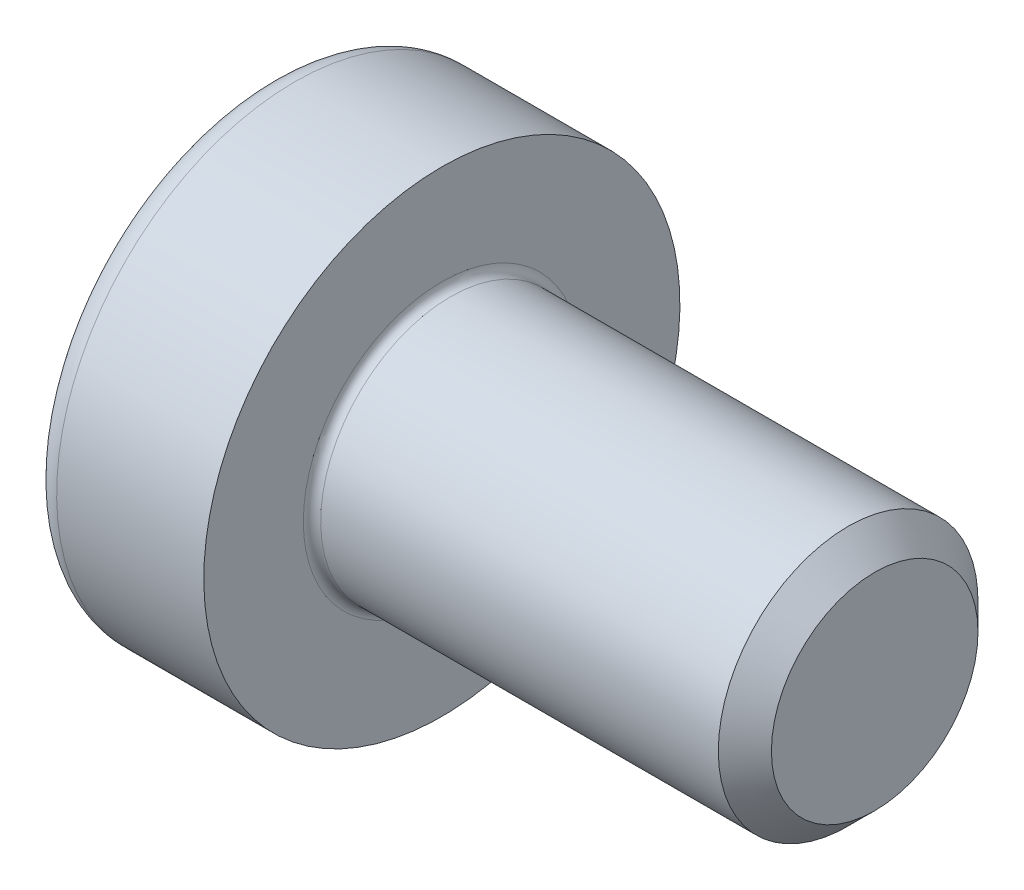
ISO-10303-21;
HEADER;
FILE_DESCRIPTION(('STEP AP214'),'2;1');
FILE_NAME('part.step','',(''),(''),'','','');
FILE_SCHEMA(('AUTOMOTIVE_DESIGN { 1 0 10303 214 1 1 1 1 }'));
ENDSEC;
DATA;
#1=APPLICATION_CONTEXT('core data for automotive mechanical design processes');
#2=APPLICATION_PROTOCOL_DEFINITION('international standard','automotive_design',2000,#1);
#3=PRODUCT_CONTEXT('',#1,'mechanical');
#4=PRODUCT('Part','Part','',(#3));
#5=PRODUCT_RELATED_PRODUCT_CATEGORY('part','',(#4));
#6=PRODUCT_DEFINITION_FORMATION('','',#4);
#7=PRODUCT_DEFINITION_CONTEXT('part definition',#1,'design');
#8=PRODUCT_DEFINITION('design','',#6,#7);
#9=PRODUCT_DEFINITION_SHAPE('','',#8);
#10=(LENGTH_UNIT() NAMED_UNIT(*) SI_UNIT(.MILLI.,.METRE.));
#11=(NAMED_UNIT(*) PLANE_ANGLE_UNIT() SI_UNIT($,.RADIAN.));
#12=(NAMED_UNIT(*) SI_UNIT($,.STERADIAN.) SOLID_ANGLE_UNIT());
#13=UNCERTAINTY_MEASURE_WITH_UNIT(LENGTH_MEASURE(1.E-05),#10,'distance_accuracy_value','');
#14=(GEOMETRIC_REPRESENTATION_CONTEXT(3) GLOBAL_UNCERTAINTY_ASSIGNED_CONTEXT((#13)) GLOBAL_UNIT_ASSIGNED_CONTEXT((#10,
#11,#12)) REPRESENTATION_CONTEXT('',''));
#15=CARTESIAN_POINT('',(0.,0.,0.));
#16=DIRECTION('',(0.,0.,1.));
#17=DIRECTION('',(1.,0.,0.));
#18=AXIS2_PLACEMENT_3D('',#15,#16,#17);
#19=CARTESIAN_POINT('',(-0.503999999864391,0.,0.));
#20=DIRECTION('',(-1.,0.,0.));
#21=DIRECTION('',(0.,-1.,0.));
#22=AXIS2_PLACEMENT_3D('',#19,#20,#21);
#23=CONICAL_SURFACE('',#22,1.16162874127212,1.04719755078912);
#24=CARTESIAN_POINT('',(0.166666666927995,-2.27373675443232E-10,0.));
#25=VERTEX_POINT('',#24);
#26=VERTEX_LOOP('',#25);
#27=FACE_BOUND('',#26,.T.);
#28=CARTESIAN_POINT('',(-0.500000000054538,-2.66034933447051E-12,-1.15470053837771));
#29=CARTESIAN_POINT('',(-0.485347772602941,-0.0439439437877839,-1.12932949060412));
#30=CARTESIAN_POINT('',(-0.472022338576027,-0.0882672110712172,-1.10373944030667));
#31=CARTESIAN_POINT('',(-0.448763193702326,-0.177681173363933,-1.05211626510765));
#32=CARTESIAN_POINT('',(-0.438837710161239,-0.22277345656913,-1.02608222326076));
#33=CARTESIAN_POINT('',(-0.423387979450925,-0.31239921691698,-0.974336766397603));
#34=CARTESIAN_POINT('',(-0.417760893771708,-0.356918907850494,-0.9486333108529));
#35=CARTESIAN_POINT('',(-0.411044584034606,-0.446167660283064,-0.897105519611117));
#36=CARTESIAN_POINT('',(-0.409949796957221,-0.490896397609755,-0.87128137107504));
#37=CARTESIAN_POINT('',(-0.412233145053628,-0.574467244911864,-0.823031719888762));
#38=CARTESIAN_POINT('',(-0.415050642588264,-0.613321895373819,-0.800598976985284));
#39=CARTESIAN_POINT('',(-0.423978650349042,-0.690778070923615,-0.75587963318121));
#40=CARTESIAN_POINT('',(-0.430092207380232,-0.729379328311183,-0.73359318683744));
#41=CARTESIAN_POINT('',(-0.445374916678936,-0.806995070887484,-0.688781716967659));
#42=CARTESIAN_POINT('',(-0.454608821127005,-0.845999737712036,-0.666262362076853));
#43=CARTESIAN_POINT('',(-0.475565880455007,-0.92342748501189,-0.621559431330535));
#44=CARTESIAN_POINT('',(-0.48728411442082,-0.961851556660948,-0.599375283220591));
#45=CARTESIAN_POINT('',(-0.500000000054538,-0.999999999997338,-0.57735026919116));
#46=B_SPLINE_CURVE_WITH_KNOTS('',3,(#28,#29,#30,#31,#32,#33,#34,#35,#36,#37,#38,#39,#40,#41,#42,
#43,#44,#45),.UNSPECIFIED.,.F.,.F.,(4,2,2,2,2,2,2,2,4),(0.,0.158508005803016,0.317396908563659,
0.472353803143989,0.627120444533385,0.761853891383376,0.89671209694782,1.03456081128291,
1.17213898678349),.UNSPECIFIED.);
#47=CARTESIAN_POINT('',(-0.500000000054409,3.90597052142701E-13,-1.15470053837749));
#48=VERTEX_POINT('',#47);
#49=CARTESIAN_POINT('',(-0.500000000054982,-0.999999999998669,-0.577350269190392));
#50=VERTEX_POINT('',#49);
#51=EDGE_CURVE('E66',#48,#50,#46,.T.);
#52=ORIENTED_EDGE('',*,*,#51,.T.);
#53=CARTESIAN_POINT('',(-0.500000000054279,-1.,-0.577350269185651));
#54=CARTESIAN_POINT('',(-0.486316886478298,-1.,-0.529955537081926));
#55=CARTESIAN_POINT('',(-0.473789609988564,-1.,-0.482185870571547));
#56=CARTESIAN_POINT('',(-0.451649203168449,-1.,-0.385870552395111));
#57=CARTESIAN_POINT('',(-0.442042593062085,-1.,-0.337323415544137));
#58=CARTESIAN_POINT('',(-0.426594000994846,-1.,-0.24077388415078));
#59=CARTESIAN_POINT('',(-0.420669653607927,-1.,-0.192785083012187));
#60=CARTESIAN_POINT('',(-0.412716568630853,-1.,-0.0965306160797558));
#61=CARTESIAN_POINT('',(-0.410683602494335,-1.,-0.0482653080398779));
#62=CARTESIAN_POINT('',(-0.410683602494335,-1.,0.048265308039878));
#63=CARTESIAN_POINT('',(-0.412716568630854,-1.,0.096530616079756));
#64=CARTESIAN_POINT('',(-0.420669653607927,-1.,0.192785083012187));
#65=CARTESIAN_POINT('',(-0.426594000994847,-1.,0.24077388415078));
#66=CARTESIAN_POINT('',(-0.442042593062085,-1.,0.337323415544138));
#67=CARTESIAN_POINT('',(-0.451649203168449,-1.,0.385870552395112));
#68=CARTESIAN_POINT('',(-0.473789609988564,-1.,0.482185870571548));
#69=CARTESIAN_POINT('',(-0.486316886478298,-1.,0.529955537081928));
#70=CARTESIAN_POINT('',(-0.500000000054279,-1.,0.577350269185653));
#71=B_SPLINE_CURVE_WITH_KNOTS('',3,(#53,#54,#55,#56,#57,#58,#59,#60,#61,#62,#63,#64,#65,#66,#67,
#68,#69,#70),.UNSPECIFIED.,.F.,.F.,(4,2,2,2,2,2,2,2,4),(0.,0.148036697964357,0.296401493056179,
0.441315429597071,0.58607180667426,0.73082818375145,0.875742120292343,1.02410691538417,
1.17214361334852),.UNSPECIFIED.);
#72=CARTESIAN_POINT('',(-0.500000000054409,-0.999999999998669,0.577350269188408));
#73=VERTEX_POINT('',#72);
#74=EDGE_CURVE('E69',#50,#73,#71,.T.);
#75=ORIENTED_EDGE('',*,*,#74,.T.);
#76=CARTESIAN_POINT('',(-0.500000000054539,-0.999999999997339,0.577350269191163));
#77=CARTESIAN_POINT('',(-0.485347772602941,-0.956056056212215,0.602721316964758));
#78=CARTESIAN_POINT('',(-0.472022338576028,-0.911732788928782,0.628311367262211));
#79=CARTESIAN_POINT('',(-0.448763193702326,-0.822318826636067,0.679934542461221));
#80=CARTESIAN_POINT('',(-0.438837710161239,-0.77722654343087,0.705968584308117));
#81=CARTESIAN_POINT('',(-0.423387979450925,-0.68760078308302,0.757714041171273));
#82=CARTESIAN_POINT('',(-0.417760893771709,-0.643081092149505,0.783417496715976));
#83=CARTESIAN_POINT('',(-0.411044584034607,-0.553832339716935,0.834945287957759));
#84=CARTESIAN_POINT('',(-0.409949796957222,-0.509103602390243,0.860769436493837));
#85=CARTESIAN_POINT('',(-0.412233145053627,-0.4255327550882,0.909019087680076));
#86=CARTESIAN_POINT('',(-0.415050642588255,-0.386678104626311,0.931451830583517));
#87=CARTESIAN_POINT('',(-0.423978650349008,-0.309221929076646,0.976171174387514));
#88=CARTESIAN_POINT('',(-0.430092207380179,-0.270620671689143,0.998457620731247));
#89=CARTESIAN_POINT('',(-0.445374916678836,-0.193004929112973,1.04326909060095));
#90=CARTESIAN_POINT('',(-0.454608821126878,-0.154000262288488,1.06578844549172));
#91=CARTESIAN_POINT('',(-0.475565880454818,-0.0765725149887629,1.11049137623796));
#92=CARTESIAN_POINT('',(-0.487284114420597,-0.0381484433397693,1.13267552434787));
#93=CARTESIAN_POINT('',(-0.500000000054279,-3.44179178912702E-12,1.15470053837726));
#94=B_SPLINE_CURVE_WITH_KNOTS('',3,(#76,#77,#78,#79,#80,#81,#82,#83,#84,#85,#86,#87,#88,#89,#90,
#91,#92,#93),.UNSPECIFIED.,.F.,.F.,(4,2,2,2,2,2,2,2,4),(0.,0.158508005803015,0.317396908563657,
0.472353803143989,0.627120444533386,0.761853891383148,0.896712096947362,1.03456081128221,
1.17213898678255),.UNSPECIFIED.);
#95=CARTESIAN_POINT('',(-0.500000000054408,-3.90699793476975E-13,1.15470053837749));
#96=VERTEX_POINT('',#95);
#97=EDGE_CURVE('E99',#73,#96,#94,.T.);
#98=ORIENTED_EDGE('',*,*,#97,.T.);
#99=CARTESIAN_POINT('',(-0.500000000054538,2.6603251142067E-12,1.15470053837771));
#100=CARTESIAN_POINT('',(-0.48534777260294,0.0439439437877836,1.12932949060412));
#101=CARTESIAN_POINT('',(-0.472022338576027,0.0882672110712165,1.10373944030667));
#102=CARTESIAN_POINT('',(-0.448763193702326,0.177681173363931,1.05211626510766));
#103=CARTESIAN_POINT('',(-0.438837710161239,0.222773456569128,1.02608222326076));
#104=CARTESIAN_POINT('',(-0.423387979450925,0.312399216916978,0.974336766397604));
#105=CARTESIAN_POINT('',(-0.417760893771708,0.356918907850493,0.9486333108529));
#106=CARTESIAN_POINT('',(-0.411044584034606,0.446167660283063,0.897105519611117));
#107=CARTESIAN_POINT('',(-0.40994979695722,0.490896397609754,0.87128137107504));
#108=CARTESIAN_POINT('',(-0.412233145053626,0.574467244911798,0.8230317198888));
#109=CARTESIAN_POINT('',(-0.415050642588254,0.613321895373687,0.800598976985359));
#110=CARTESIAN_POINT('',(-0.423978650349006,0.690778070923352,0.755879633181361));
#111=CARTESIAN_POINT('',(-0.430092207380177,0.729379328310856,0.733593186837628));
#112=CARTESIAN_POINT('',(-0.445374916678835,0.806995070887027,0.688781716967922));
#113=CARTESIAN_POINT('',(-0.454608821126877,0.845999737711512,0.666262362077154));
#114=CARTESIAN_POINT('',(-0.475565880454817,0.923427485011238,0.621559431330911));
#115=CARTESIAN_POINT('',(-0.487284114420596,0.961851556660231,0.599375283221003));
#116=CARTESIAN_POINT('',(-0.500000000054278,0.999999999996559,0.577350269191609));
#117=B_SPLINE_CURVE_WITH_KNOTS('',3,(#99,#100,#101,#102,#103,#104,#105,#106,#107,#108,#109,#110,
#111,#112,#113,#114,#115,#116),.UNSPECIFIED.,.F.,.F.,(4,2,2,2,2,2,2,2,4),(0.,0.158508005803014,
0.317396908563657,0.472353803143988,0.627120444533385,0.761853891383148,0.896712096947364,
1.03456081128221,1.17213898678255),.UNSPECIFIED.);
#118=CARTESIAN_POINT('',(-0.500000000054408,0.99999999999828,0.57735026918908));
#119=VERTEX_POINT('',#118);
#120=EDGE_CURVE('E105',#96,#119,#117,.T.);
#121=ORIENTED_EDGE('',*,*,#120,.T.);
#122=CARTESIAN_POINT('',(-0.500000000054538,1.,0.57735026918655));
#123=CARTESIAN_POINT('',(-0.486316886478521,1.,0.529955537082753));
#124=CARTESIAN_POINT('',(-0.473789609988752,1.,0.482185870572301));
#125=CARTESIAN_POINT('',(-0.451649203168574,1.,0.385870552395717));
#126=CARTESIAN_POINT('',(-0.442042593062181,1.,0.337323415544668));
#127=CARTESIAN_POINT('',(-0.426594000994896,1.,0.24077388415116));
#128=CARTESIAN_POINT('',(-0.420669653607958,0.999999999999999,0.192785083012492));
#129=CARTESIAN_POINT('',(-0.41271656863086,0.999999999999999,0.096530616079909));
#130=CARTESIAN_POINT('',(-0.410683602494336,0.999999999999999,0.0482653080399545));
#131=CARTESIAN_POINT('',(-0.410683602494335,0.999999999999999,-0.0482653080396671));
#132=CARTESIAN_POINT('',(-0.412716568630835,0.999999999999999,-0.0965306160793342));
#133=CARTESIAN_POINT('',(-0.42066965360784,0.999999999999999,-0.192785083011347));
#134=CARTESIAN_POINT('',(-0.426594000994709,0.999999999999999,-0.240773884149733));
#135=CARTESIAN_POINT('',(-0.442042593061818,0.999999999999999,-0.337323415542671));
#136=CARTESIAN_POINT('',(-0.451649203168104,0.999999999999999,-0.385870552393433));
#137=CARTESIAN_POINT('',(-0.473789609988042,0.999999999999999,-0.482185870569453));
#138=CARTESIAN_POINT('',(-0.486316886477679,0.999999999999998,-0.52995553707963));
#139=CARTESIAN_POINT('',(-0.500000000053557,0.999999999999998,-0.577350269183155));
#140=B_SPLINE_CURVE_WITH_KNOTS('',3,(#122,#123,#124,#125,#126,#127,#128,#129,#130,#131,#132,
#133,#134,#135,#136,#137,#138,#139),.UNSPECIFIED.,.F.,.F.,(4,2,2,2,2,2,2,2,4),(0.,
0.148036697964594,0.296401493056653,0.441315429597776,0.586071806675195,0.730828183751753,
0.875742120292011,1.02410691538316,1.17214361334686),.UNSPECIFIED.);
#141=CARTESIAN_POINT('',(-0.500000000054596,1.00000000000031,-0.577350269186209));
#142=VERTEX_POINT('',#141);
#143=EDGE_CURVE('E111',#119,#142,#140,.T.);
#144=ORIENTED_EDGE('',*,*,#143,.T.);
#145=CARTESIAN_POINT('',(-0.500000000055635,1.00000000000063,-0.577350269189264));
#146=CARTESIAN_POINT('',(-0.485347772603948,0.95605605621545,-0.60272131696289));
#147=CARTESIAN_POINT('',(-0.47202233857694,0.911732788931962,-0.628311367260376));
#148=CARTESIAN_POINT('',(-0.44876319370304,0.822318826639132,-0.679934542459452));
#149=CARTESIAN_POINT('',(-0.43883771016185,0.777226543433875,-0.705968584306382));
#150=CARTESIAN_POINT('',(-0.423387979451333,0.687600783085905,-0.757714041169608));
#151=CARTESIAN_POINT('',(-0.417760893772015,0.64308109215233,-0.783417496714346));
#152=CARTESIAN_POINT('',(-0.411044584034717,0.553832339719633,-0.834945287956202));
#153=CARTESIAN_POINT('',(-0.409949796957238,0.509103602392874,-0.860769436492318));
#154=CARTESIAN_POINT('',(-0.412233145053487,0.425532755090552,-0.909019087678719));
#155=CARTESIAN_POINT('',(-0.415050642588064,0.386678104628451,-0.931451830582281));
#156=CARTESIAN_POINT('',(-0.423978650348755,0.309221929078364,-0.976171174386524));
#157=CARTESIAN_POINT('',(-0.430092207379916,0.270620671690648,-0.998457620730379));
#158=CARTESIAN_POINT('',(-0.445374916678591,0.193004929114046,-1.04326909060033));
#159=CARTESIAN_POINT('',(-0.454608821126661,0.154000262289341,-1.06578844549123));
#160=CARTESIAN_POINT('',(-0.475565880454689,0.0765725149891845,-1.11049137623772));
#161=CARTESIAN_POINT('',(-0.487284114420527,0.0381484433399783,-1.13267552434775));
#162=CARTESIAN_POINT('',(-0.500000000054279,3.44156857168414E-12,-1.15470053837726));
#163=B_SPLINE_CURVE_WITH_KNOTS('',3,(#145,#146,#147,#148,#149,#150,#151,#152,#153,#154,#155,
#156,#157,#158,#159,#160,#161,#162),.UNSPECIFIED.,.F.,.F.,(4,2,2,2,2,2,2,2,4),(0.,
0.158508005803271,0.317396908564176,0.472353803144747,0.627120444534381,0.761853891384862,
0.896712096949797,1.0345608112854,1.1721389867865),.UNSPECIFIED.);
#164=EDGE_CURVE('E59',#142,#48,#163,.T.);
#165=ORIENTED_EDGE('',*,*,#164,.T.);
#166=EDGE_LOOP('',(#52,#75,#98,#121,#144,#165));
#167=FACE_BOUND('',#166,.T.);
#168=ADVANCED_FACE('F17',(#27,#167),#23,.F.);
#169=CARTESIAN_POINT('',(-2.,0.,-1.15470053837925));
#170=DIRECTION('',(0.,-0.5,-0.866025403784438));
#171=DIRECTION('',(0.,0.866025403784438,-0.5));
#172=AXIS2_PLACEMENT_3D('',#169,#170,#171);
#173=PLANE('',#172);
#174=DIRECTION('',(0.,0.866025403784438,-0.500000000000001));
#175=VECTOR('',#174,1.);
#176=CARTESIAN_POINT('',(-2.,-1.,-0.577350269189624));
#177=LINE('',#176,#175);
#178=CARTESIAN_POINT('',(-2.,-1.,-0.577350269189624));
#179=VERTEX_POINT('',#178);
#180=CARTESIAN_POINT('',(-2.,1.28996841789761E-12,-1.15470053837864));
#181=VERTEX_POINT('',#180);
#182=EDGE_CURVE('E78',#179,#181,#177,.T.);
#183=ORIENTED_EDGE('',*,*,#182,.F.);
#184=DIRECTION('',(1.,0.,0.));
#185=VECTOR('',#184,1.);
#186=CARTESIAN_POINT('',(-2.,-1.,-0.577350269189624));
#187=LINE('',#186,#185);
#188=EDGE_CURVE('E76',#179,#50,#187,.T.);
#189=ORIENTED_EDGE('',*,*,#188,.T.);
#190=ORIENTED_EDGE('',*,*,#51,.F.);
#191=DIRECTION('',(1.,0.,0.));
#192=VECTOR('',#191,1.);
#193=CARTESIAN_POINT('',(-2.,2.81458883977237E-12,-1.15470053837763));
#194=LINE('',#193,#192);
#195=EDGE_CURVE('E114',#48,#181,#194,.F.);
#196=ORIENTED_EDGE('',*,*,#195,.T.);
#197=EDGE_LOOP('',(#183,#189,#190,#196));
#198=FACE_BOUND('',#197,.T.);
#199=ADVANCED_FACE('F64',(#198),#173,.F.);
#200=CARTESIAN_POINT('',(-2.,0.999999999999999,-0.577350269189627));
#201=DIRECTION('',(0.,0.5,-0.866025403784439));
#202=DIRECTION('',(0.,0.866025403784439,0.5));
#203=AXIS2_PLACEMENT_3D('',#200,#201,#202);
#204=PLANE('',#203);
#205=DIRECTION('',(0.,0.866025403784439,0.499999999999999));
#206=VECTOR('',#205,1.);
#207=CARTESIAN_POINT('',(-2.,0.,-1.15470053837925));
#208=LINE('',#207,#206);
#209=CARTESIAN_POINT('',(-2.,0.999999999999999,-0.577350269185565));
#210=VERTEX_POINT('',#209);
#211=EDGE_CURVE('E84',#181,#210,#208,.T.);
#212=ORIENTED_EDGE('',*,*,#211,.F.);
#213=ORIENTED_EDGE('',*,*,#195,.F.);
#214=ORIENTED_EDGE('',*,*,#164,.F.);
#215=DIRECTION('',(1.,0.,0.));
#216=VECTOR('',#215,1.);
#217=CARTESIAN_POINT('',(-2.,0.999999999999998,-0.577350269183128));
#218=LINE('',#217,#216);
#219=EDGE_CURVE('E108',#142,#210,#218,.F.);
#220=ORIENTED_EDGE('',*,*,#219,.T.);
#221=EDGE_LOOP('',(#212,#213,#214,#220));
#222=FACE_BOUND('',#221,.T.);
#223=ADVANCED_FACE('F198',(#222),#204,.F.);
#224=CARTESIAN_POINT('',(-2.,1.,0.577350269189624));
#225=DIRECTION('',(0.,1.,0.));
#226=DIRECTION('',(0.,0.,1.));
#227=AXIS2_PLACEMENT_3D('',#224,#225,#226);
#228=PLANE('',#227);
#229=DIRECTION('',(0.,0.,1.));
#230=VECTOR('',#229,1.);
#231=CARTESIAN_POINT('',(-2.,0.999999999999999,0.));
#232=LINE('',#231,#230);
#233=CARTESIAN_POINT('',(-2.,0.999999999998241,0.577350269190638));
#234=VERTEX_POINT('',#233);
#235=EDGE_CURVE('E133',#210,#234,#232,.T.);
#236=ORIENTED_EDGE('',*,*,#235,.F.);
#237=ORIENTED_EDGE('',*,*,#219,.F.);
#238=ORIENTED_EDGE('',*,*,#143,.F.);
#239=DIRECTION('',(1.,0.,0.));
#240=VECTOR('',#239,1.);
#241=CARTESIAN_POINT('',(-2.,0.999999999997186,0.577350269191247));
#242=LINE('',#241,#240);
#243=EDGE_CURVE('E102',#119,#234,#242,.F.);
#244=ORIENTED_EDGE('',*,*,#243,.T.);
#245=EDGE_LOOP('',(#236,#237,#238,#244));
#246=FACE_BOUND('',#245,.T.);
#247=ADVANCED_FACE('F201',(#246),#228,.F.);
#248=CARTESIAN_POINT('',(-2.,0.,1.15470053837925));
#249=DIRECTION('',(0.,0.500000000000001,0.866025403784438));
#250=DIRECTION('',(0.,-0.866025403784438,0.500000000000001));
#251=AXIS2_PLACEMENT_3D('',#248,#249,#250);
#252=PLANE('',#251);
#253=DIRECTION('',(0.,-0.866025403784438,0.500000000000001));
#254=VECTOR('',#253,1.);
#255=CARTESIAN_POINT('',(-2.,0.999999999999999,0.577350269189624));
#256=LINE('',#255,#254);
#257=CARTESIAN_POINT('',(-2.,-1.75929001448491E-12,1.15470053837824));
#258=VERTEX_POINT('',#257);
#259=EDGE_CURVE('E128',#234,#258,#256,.T.);
#260=ORIENTED_EDGE('',*,*,#259,.F.);
#261=ORIENTED_EDGE('',*,*,#243,.F.);
#262=ORIENTED_EDGE('',*,*,#120,.F.);
#263=DIRECTION('',(1.,0.,0.));
#264=VECTOR('',#263,1.);
#265=CARTESIAN_POINT('',(-2.,-2.81480568020687E-12,1.15470053837763));
#266=LINE('',#265,#264);
#267=EDGE_CURVE('E96',#96,#258,#266,.F.);
#268=ORIENTED_EDGE('',*,*,#267,.T.);
#269=EDGE_LOOP('',(#260,#261,#262,#268));
#270=FACE_BOUND('',#269,.T.);
#271=ADVANCED_FACE('F205',(#270),#252,.F.);
#272=CARTESIAN_POINT('',(-2.,-1.,0.577350269189626));
#273=DIRECTION('',(0.,-0.5,0.866025403784439));
#274=DIRECTION('',(0.,-0.866025403784439,-0.5));
#275=AXIS2_PLACEMENT_3D('',#272,#273,#274);
#276=PLANE('',#275);
#277=DIRECTION('',(0.,-0.866025403784439,-0.499999999999999));
#278=VECTOR('',#277,1.);
#279=CARTESIAN_POINT('',(-2.,0.,1.15470053837925));
#280=LINE('',#279,#278);
#281=CARTESIAN_POINT('',(-2.,-1.,0.577350269187595));
#282=VERTEX_POINT('',#281);
#283=EDGE_CURVE('E123',#258,#282,#280,.T.);
#284=ORIENTED_EDGE('',*,*,#283,.F.);
#285=ORIENTED_EDGE('',*,*,#267,.F.);
#286=ORIENTED_EDGE('',*,*,#97,.F.);
#287=DIRECTION('',(1.,0.,0.));
#288=VECTOR('',#287,1.);
#289=CARTESIAN_POINT('',(-2.,-1.,0.577350269186377));
#290=LINE('',#289,#288);
#291=EDGE_CURVE('E82',#73,#282,#290,.F.);
#292=ORIENTED_EDGE('',*,*,#291,.T.);
#293=EDGE_LOOP('',(#284,#285,#286,#292));
#294=FACE_BOUND('',#293,.T.);
#295=ADVANCED_FACE('F209',(#294),#276,.F.);
#296=CARTESIAN_POINT('',(-2.,-1.,-0.577350269189625));
#297=DIRECTION('',(0.,-1.,0.));
#298=DIRECTION('',(1.,0.,0.));
#299=AXIS2_PLACEMENT_3D('',#296,#297,#298);
#300=PLANE('',#299);
#301=DIRECTION('',(0.,0.,1.));
#302=VECTOR('',#301,1.);
#303=CARTESIAN_POINT('',(-2.,-1.,0.));
#304=LINE('',#303,#302);
#305=EDGE_CURVE('E120',#282,#179,#304,.F.);
#306=ORIENTED_EDGE('',*,*,#305,.F.);
#307=ORIENTED_EDGE('',*,*,#291,.F.);
#308=ORIENTED_EDGE('',*,*,#74,.F.);
#309=ORIENTED_EDGE('',*,*,#188,.F.);
#310=EDGE_LOOP('',(#306,#307,#308,#309));
#311=FACE_BOUND('',#310,.T.);
#312=ADVANCED_FACE('F165',(#311),#300,.F.);
#313=CARTESIAN_POINT('',(-2.,1.95235026918963,0.));
#314=DIRECTION('',(-1.,0.,0.));
#315=DIRECTION('',(0.,-1.,0.));
#316=AXIS2_PLACEMENT_3D('',#313,#314,#315);
#317=PLANE('',#316);
#318=CARTESIAN_POINT('',(-2.,0.,0.));
#319=DIRECTION('',(1.,0.,0.));
#320=DIRECTION('',(0.,1.,0.));
#321=AXIS2_PLACEMENT_3D('',#318,#319,#320);
#322=CIRCLE('',#321,2.45);
#323=CARTESIAN_POINT('',(-2.,2.45,0.));
#324=VERTEX_POINT('',#323);
#325=EDGE_CURVE('E122',#324,#324,#322,.T.);
#326=ORIENTED_EDGE('',*,*,#325,.F.);
#327=EDGE_LOOP('',(#326));
#328=FACE_BOUND('',#327,.T.);
#329=ORIENTED_EDGE('',*,*,#283,.T.);
#330=ORIENTED_EDGE('',*,*,#305,.T.);
#331=ORIENTED_EDGE('',*,*,#182,.T.);
#332=ORIENTED_EDGE('',*,*,#211,.T.);
#333=ORIENTED_EDGE('',*,*,#235,.T.);
#334=ORIENTED_EDGE('',*,*,#259,.T.);
#335=EDGE_LOOP('',(#329,#330,#331,#332,#333,#334));
#336=FACE_BOUND('',#335,.T.);
#337=ADVANCED_FACE('F218',(#328,#336),#317,.T.);
#338=CARTESIAN_POINT('',(-1.7,0.,0.));
#339=DIRECTION('',(1.,0.,0.));
#340=DIRECTION('',(0.,1.,0.));
#341=AXIS2_PLACEMENT_3D('',#338,#339,#340);
#342=TOROIDAL_SURFACE('',#341,2.45,0.300000000000001);
#343=CARTESIAN_POINT('',(-1.7,0.,0.));
#344=DIRECTION('',(1.,0.,0.));
#345=DIRECTION('',(0.,1.,0.));
#346=AXIS2_PLACEMENT_3D('',#343,#344,#345);
#347=CIRCLE('',#346,2.75);
#348=CARTESIAN_POINT('',(-1.7,2.75,0.));
#349=VERTEX_POINT('',#348);
#350=EDGE_CURVE('E90',#349,#349,#347,.T.);
#351=ORIENTED_EDGE('',*,*,#350,.F.);
#352=EDGE_LOOP('',(#351));
#353=FACE_BOUND('',#352,.T.);
#354=ORIENTED_EDGE('',*,*,#325,.T.);
#355=EDGE_LOOP('',(#354));
#356=FACE_BOUND('',#355,.T.);
#357=ADVANCED_FACE('F172',(#353,#356),#342,.T.);
#358=CARTESIAN_POINT('',(-0.999999999999996,0.,0.));
#359=DIRECTION('',(1.,0.,0.));
#360=DIRECTION('',(0.,1.,0.));
#361=AXIS2_PLACEMENT_3D('',#358,#359,#360);
#362=CYLINDRICAL_SURFACE('',#361,2.75);
#363=ORIENTED_EDGE('',*,*,#350,.T.);
#364=EDGE_LOOP('',(#363));
#365=FACE_BOUND('',#364,.T.);
#366=CARTESIAN_POINT('',(0.,0.,0.));
#367=DIRECTION('',(1.,0.,0.));
#368=DIRECTION('',(0.,1.,0.));
#369=AXIS2_PLACEMENT_3D('',#366,#367,#368);
#370=CIRCLE('',#369,2.75);
#371=CARTESIAN_POINT('',(0.,2.75,0.));
#372=VERTEX_POINT('',#371);
#373=EDGE_CURVE('E149',#372,#372,#370,.T.);
#374=ORIENTED_EDGE('',*,*,#373,.F.);
#375=EDGE_LOOP('',(#374));
#376=FACE_BOUND('',#375,.T.);
#377=ADVANCED_FACE('F240',(#365,#376),#362,.T.);
#378=CARTESIAN_POINT('',(0.,2.125,0.));
#379=DIRECTION('',(1.,0.,0.));
#380=DIRECTION('',(0.,1.,0.));
#381=AXIS2_PLACEMENT_3D('',#378,#379,#380);
#382=PLANE('',#381);
#383=ORIENTED_EDGE('',*,*,#373,.T.);
#384=EDGE_LOOP('',(#383));
#385=FACE_BOUND('',#384,.T.);
#386=CARTESIAN_POINT('',(0.,0.,-1.6));
#387=CARTESIAN_POINT('',(0.,-0.304449951016725,-1.6001009257119));
#388=CARTESIAN_POINT('',(0.,-0.588951535298995,-1.48766128169989));
#389=CARTESIAN_POINT('',(0.,-0.896214094659146,-1.36622613089104));
#390=CARTESIAN_POINT('',(0.,-1.13137084989847,-1.13137084989848));
#391=CARTESIAN_POINT('',(0.,-1.36508531011187,-0.897956014889474));
#392=CARTESIAN_POINT('',(0.,-1.48766128169989,-0.588951535299007));
#393=CARTESIAN_POINT('',(0.,-1.59980408211201,-0.306248267829627));
#394=CARTESIAN_POINT('',(0.,-1.6,0.));
#395=CARTESIAN_POINT('',(0.,-1.60019461578501,0.304212890729989));
#396=CARTESIAN_POINT('',(0.,-1.48766128169989,0.588951535298987));
#397=CARTESIAN_POINT('',(0.,-1.36622613089144,0.89621409465832));
#398=CARTESIAN_POINT('',(0.,-1.13137084989848,1.13137084989847));
#399=CARTESIAN_POINT('',(0.,-0.897956014890013,1.36508531011175));
#400=CARTESIAN_POINT('',(0.,-0.588951535299002,1.48766128169989));
#401=CARTESIAN_POINT('',(0.,-0.306010103754814,1.59989855709463));
#402=CARTESIAN_POINT('',(0.,0.,1.6));
#403=B_SPLINE_CURVE_WITH_KNOTS('',2,(#386,#387,#388,#389,#390,#391,#392,#393,#394,#395,#396,
#397,#398,#399,#400,#401,#402),.UNSPECIFIED.,.F.,.F.,(3,2,2,2,2,2,2,2,3),(0.,0.125,0.25,0.375,
0.5,0.625,0.75,0.875,1.),.UNSPECIFIED.);
#404=CARTESIAN_POINT('',(0.,0.,-1.6));
#405=VERTEX_POINT('',#404);
#406=CARTESIAN_POINT('',(0.,0.,1.6));
#407=VERTEX_POINT('',#406);
#408=EDGE_CURVE('E34',#405,#407,#403,.T.);
#409=ORIENTED_EDGE('',*,*,#408,.T.);
#410=CARTESIAN_POINT('',(0.,0.,1.6));
#411=CARTESIAN_POINT('',(0.,0.304449951016785,1.6001009257119));
#412=CARTESIAN_POINT('',(0.,0.588951535299,1.48766128169989));
#413=CARTESIAN_POINT('',(0.,0.89621409465884,1.36622613089113));
#414=CARTESIAN_POINT('',(0.,1.13137084989848,1.13137084989847));
#415=CARTESIAN_POINT('',(0.,1.36508499852708,0.897956326075019));
#416=CARTESIAN_POINT('',(0.,1.48766128169989,0.588951535298992));
#417=CARTESIAN_POINT('',(0.,1.59990576220706,0.305992374545344));
#418=CARTESIAN_POINT('',(0.,1.6,0.));
#419=CARTESIAN_POINT('',(0.,1.60009376834225,-0.30446805689882));
#420=CARTESIAN_POINT('',(0.,1.48766128169989,-0.588951535299003));
#421=CARTESIAN_POINT('',(0.,1.36622613380686,-0.896214091739088));
#422=CARTESIAN_POINT('',(0.,1.13137084989847,-1.13137084989848));
#423=CARTESIAN_POINT('',(0.,0.897956014889921,-1.36508531011191));
#424=CARTESIAN_POINT('',(0.,0.588951535298992,-1.48766128169989));
#425=CARTESIAN_POINT('',(0.,0.306010103754522,-1.59989855709463));
#426=CARTESIAN_POINT('',(0.,0.,-1.6));
#427=B_SPLINE_CURVE_WITH_KNOTS('',2,(#410,#411,#412,#413,#414,#415,#416,#417,#418,#419,#420,
#421,#422,#423,#424,#425,#426),.UNSPECIFIED.,.F.,.F.,(3,2,2,2,2,2,2,2,3),(0.,0.125,0.25,0.375,
0.5,0.625,0.75,0.875,1.),.UNSPECIFIED.);
#428=EDGE_CURVE('E152',#407,#405,#427,.T.);
#429=ORIENTED_EDGE('',*,*,#428,.T.);
#430=EDGE_LOOP('',(#409,#429));
#431=FACE_BOUND('',#430,.T.);
#432=ADVANCED_FACE('F235',(#385,#431),#382,.T.);
#433=CARTESIAN_POINT('',(5.,0.749999999999999,0.));
#434=DIRECTION('',(1.,0.,0.));
#435=DIRECTION('',(0.,1.,0.));
#436=AXIS2_PLACEMENT_3D('',#433,#434,#435);
#437=PLANE('',#436);
#438=CARTESIAN_POINT('',(4.99999999999545,0.,0.));
#439=DIRECTION('',(-1.,0.,0.));
#440=DIRECTION('',(0.,0.,1.));
#441=AXIS2_PLACEMENT_3D('',#438,#439,#440);
#442=CIRCLE('',#441,1.19327500004829);
#443=CARTESIAN_POINT('',(4.99999999999545,0.,1.19327500004829));
#444=VERTEX_POINT('',#443);
#445=EDGE_CURVE('E146',#444,#444,#442,.T.);
#446=ORIENTED_EDGE('',*,*,#445,.F.);
#447=EDGE_LOOP('',(#446));
#448=FACE_BOUND('',#447,.T.);
#449=ADVANCED_FACE('F232',(#448),#437,.T.);
#450=CARTESIAN_POINT('',(0.100000000000002,0.,0.));
#451=DIRECTION('',(1.,0.,0.));
#452=DIRECTION('',(0.,1.,0.));
#453=AXIS2_PLACEMENT_3D('',#450,#451,#452);
#454=TOROIDAL_SURFACE('',#453,1.6,0.1);
#455=ORIENTED_EDGE('',*,*,#408,.F.);
#456=ORIENTED_EDGE('',*,*,#428,.F.);
#457=EDGE_LOOP('',(#455,#456));
#458=FACE_BOUND('',#457,.T.);
#459=CARTESIAN_POINT('',(0.100000000000002,0.,0.));
#460=DIRECTION('',(1.,0.,0.));
#461=DIRECTION('',(0.,1.,0.));
#462=AXIS2_PLACEMENT_3D('',#459,#460,#461);
#463=CIRCLE('',#462,1.5);
#464=CARTESIAN_POINT('',(0.100000000000002,1.5,0.));
#465=VERTEX_POINT('',#464);
#466=EDGE_CURVE('E21',#465,#465,#463,.T.);
#467=ORIENTED_EDGE('',*,*,#466,.F.);
#468=EDGE_LOOP('',(#467));
#469=FACE_BOUND('',#468,.T.);
#470=ADVANCED_FACE('F19',(#458,#469),#454,.F.);
#471=CARTESIAN_POINT('',(4.69327500007921,0.,0.));
#472=DIRECTION('',(-1.,0.,0.));
#473=DIRECTION('',(0.,0.,1.));
#474=AXIS2_PLACEMENT_3D('',#471,#472,#473);
#475=CONICAL_SURFACE('',#474,1.49999999996453,0.785398163397448);
#476=CARTESIAN_POINT('',(4.693275,0.,0.));
#477=DIRECTION('',(1.,0.,0.));
#478=DIRECTION('',(0.,1.,0.));
#479=AXIS2_PLACEMENT_3D('',#476,#477,#478);
#480=CIRCLE('',#479,1.5);
#481=CARTESIAN_POINT('',(4.693275,1.5,0.));
#482=VERTEX_POINT('',#481);
#483=EDGE_CURVE('E11',#482,#482,#480,.F.);
#484=ORIENTED_EDGE('',*,*,#483,.F.);
#485=EDGE_LOOP('',(#484));
#486=FACE_BOUND('',#485,.T.);
#487=ORIENTED_EDGE('',*,*,#445,.T.);
#488=EDGE_LOOP('',(#487));
#489=FACE_BOUND('',#488,.T.);
#490=ADVANCED_FACE('F222',(#486,#489),#475,.T.);
#491=CARTESIAN_POINT('',(3.25,0.,0.));
#492=DIRECTION('',(1.,0.,0.));
#493=DIRECTION('',(0.,1.,0.));
#494=AXIS2_PLACEMENT_3D('',#491,#492,#493);
#495=CYLINDRICAL_SURFACE('',#494,1.5);
#496=ORIENTED_EDGE('',*,*,#483,.T.);
#497=EDGE_LOOP('',(#496));
#498=FACE_BOUND('',#497,.T.);
#499=ORIENTED_EDGE('',*,*,#466,.T.);
#500=EDGE_LOOP('',(#499));
#501=FACE_BOUND('',#500,.T.);
#502=ADVANCED_FACE('F220',(#498,#501),#495,.T.);
#503=CLOSED_SHELL('',(#168,#199,#223,#247,#271,#295,#312,#337,#357,#377,#432,#449,#470,#490,#502));
#504=MANIFOLD_SOLID_BREP('B1',#503);
#505=ADVANCED_BREP_SHAPE_REPRESENTATION('',(#18,#504),#14);
#506=SHAPE_DEFINITION_REPRESENTATION(#9,#505);
ENDSEC;
END-ISO-10303-21;
